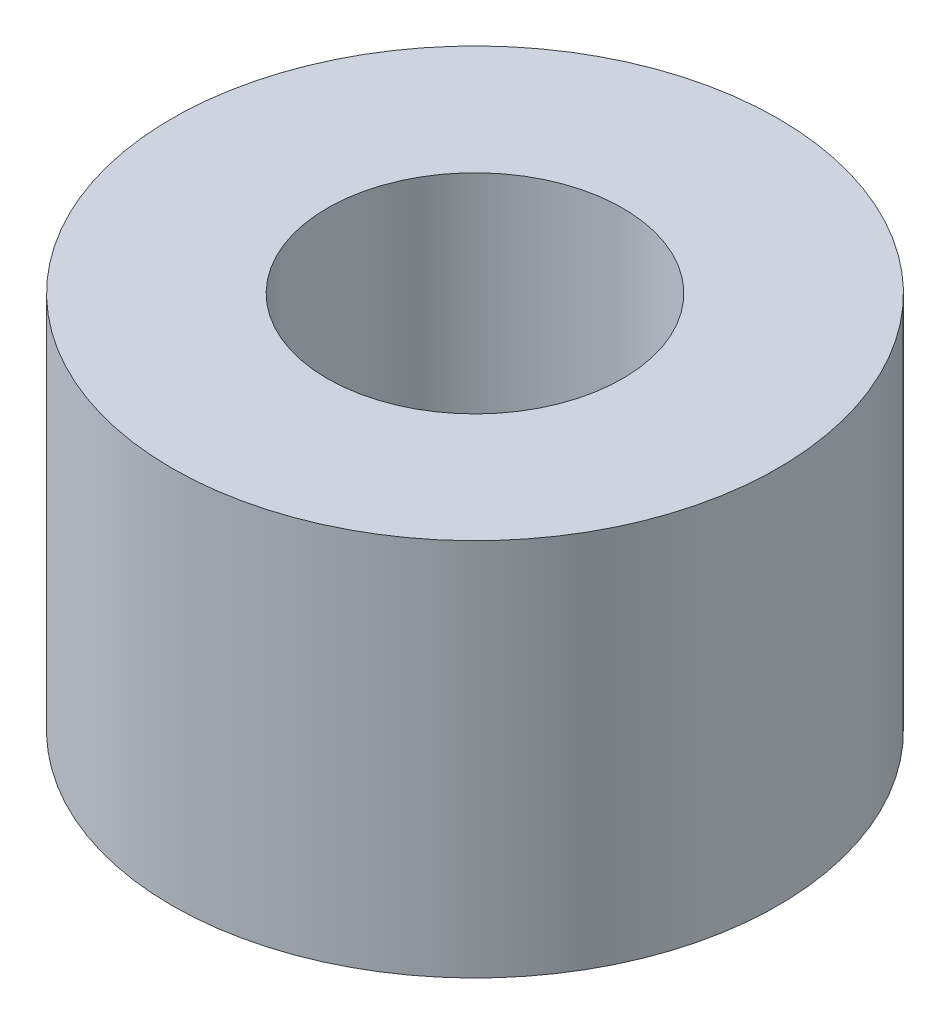
ISO-10303-21;
HEADER;
FILE_DESCRIPTION(('STEP AP214'),'2;1');
FILE_NAME('part.step','',(''),(''),'','','');
FILE_SCHEMA(('AUTOMOTIVE_DESIGN { 1 0 10303 214 1 1 1 1 }'));
ENDSEC;
DATA;
#1=APPLICATION_CONTEXT('core data for automotive mechanical design processes');
#2=APPLICATION_PROTOCOL_DEFINITION('international standard','automotive_design',2000,#1);
#3=PRODUCT_CONTEXT('',#1,'mechanical');
#4=PRODUCT('Part','Part','',(#3));
#5=PRODUCT_RELATED_PRODUCT_CATEGORY('part','',(#4));
#6=PRODUCT_DEFINITION_FORMATION('','',#4);
#7=PRODUCT_DEFINITION_CONTEXT('part definition',#1,'design');
#8=PRODUCT_DEFINITION('design','',#6,#7);
#9=PRODUCT_DEFINITION_SHAPE('','',#8);
#10=(LENGTH_UNIT() NAMED_UNIT(*) SI_UNIT(.MILLI.,.METRE.));
#11=(NAMED_UNIT(*) PLANE_ANGLE_UNIT() SI_UNIT($,.RADIAN.));
#12=(NAMED_UNIT(*) SI_UNIT($,.STERADIAN.) SOLID_ANGLE_UNIT());
#13=UNCERTAINTY_MEASURE_WITH_UNIT(LENGTH_MEASURE(1.E-05),#10,'distance_accuracy_value','');
#14=(GEOMETRIC_REPRESENTATION_CONTEXT(3) GLOBAL_UNCERTAINTY_ASSIGNED_CONTEXT((#13)) GLOBAL_UNIT_ASSIGNED_CONTEXT((#10,
#11,#12)) REPRESENTATION_CONTEXT('',''));
#15=CARTESIAN_POINT('',(0.,0.,0.));
#16=DIRECTION('',(0.,0.,1.));
#17=DIRECTION('',(1.,0.,0.));
#18=AXIS2_PLACEMENT_3D('',#15,#16,#17);
#19=CARTESIAN_POINT('',(0.,5.,0.));
#20=DIRECTION('',(0.,1.,0.));
#21=DIRECTION('',(0.,0.,1.));
#22=AXIS2_PLACEMENT_3D('',#19,#20,#21);
#23=PLANE('',#22);
#24=CARTESIAN_POINT('',(0.,5.,0.));
#25=DIRECTION('',(0.,1.,0.));
#26=DIRECTION('',(0.,0.,1.));
#27=AXIS2_PLACEMENT_3D('',#24,#25,#26);
#28=CIRCLE('',#27,4.);
#29=CARTESIAN_POINT('',(0.,5.,4.));
#30=VERTEX_POINT('',#29);
#31=EDGE_CURVE('E11',#30,#30,#28,.T.);
#32=ORIENTED_EDGE('',*,*,#31,.T.);
#33=EDGE_LOOP('',(#32));
#34=FACE_BOUND('',#33,.T.);
#35=CARTESIAN_POINT('',(0.,5.,0.));
#36=DIRECTION('',(0.,1.,0.));
#37=DIRECTION('',(0.,0.,1.));
#38=AXIS2_PLACEMENT_3D('',#35,#36,#37);
#39=CIRCLE('',#38,1.95);
#40=CARTESIAN_POINT('',(0.,5.,1.95));
#41=VERTEX_POINT('',#40);
#42=EDGE_CURVE('E44',#41,#41,#39,.T.);
#43=ORIENTED_EDGE('',*,*,#42,.F.);
#44=EDGE_LOOP('',(#43));
#45=FACE_BOUND('',#44,.T.);
#46=ADVANCED_FACE('F33',(#34,#45),#23,.T.);
#47=CARTESIAN_POINT('',(0.,0.,0.));
#48=DIRECTION('',(0.,1.,0.));
#49=DIRECTION('',(0.,0.,1.));
#50=AXIS2_PLACEMENT_3D('',#47,#48,#49);
#51=PLANE('',#50);
#52=CARTESIAN_POINT('',(0.,0.,0.));
#53=DIRECTION('',(0.,1.,0.));
#54=DIRECTION('',(0.,0.,1.));
#55=AXIS2_PLACEMENT_3D('',#52,#53,#54);
#56=CIRCLE('',#55,4.);
#57=CARTESIAN_POINT('',(0.,0.,4.));
#58=VERTEX_POINT('',#57);
#59=EDGE_CURVE('E37',#58,#58,#56,.T.);
#60=ORIENTED_EDGE('',*,*,#59,.F.);
#61=EDGE_LOOP('',(#60));
#62=FACE_BOUND('',#61,.T.);
#63=CARTESIAN_POINT('',(0.,0.,0.));
#64=DIRECTION('',(0.,1.,0.));
#65=DIRECTION('',(0.,0.,1.));
#66=AXIS2_PLACEMENT_3D('',#63,#64,#65);
#67=CIRCLE('',#66,1.95);
#68=CARTESIAN_POINT('',(0.,0.,1.95));
#69=VERTEX_POINT('',#68);
#70=EDGE_CURVE('E47',#69,#69,#67,.T.);
#71=ORIENTED_EDGE('',*,*,#70,.T.);
#72=EDGE_LOOP('',(#71));
#73=FACE_BOUND('',#72,.T.);
#74=ADVANCED_FACE('F57',(#62,#73),#51,.F.);
#75=CARTESIAN_POINT('',(0.,5.,0.));
#76=DIRECTION('',(0.,-1.,0.));
#77=DIRECTION('',(0.,0.,-1.));
#78=AXIS2_PLACEMENT_3D('',#75,#76,#77);
#79=CYLINDRICAL_SURFACE('',#78,4.);
#80=ORIENTED_EDGE('',*,*,#31,.F.);
#81=EDGE_LOOP('',(#80));
#82=FACE_BOUND('',#81,.T.);
#83=ORIENTED_EDGE('',*,*,#59,.T.);
#84=EDGE_LOOP('',(#83));
#85=FACE_BOUND('',#84,.T.);
#86=ADVANCED_FACE('F35',(#82,#85),#79,.T.);
#87=CARTESIAN_POINT('',(0.,5.,0.));
#88=DIRECTION('',(0.,-1.,0.));
#89=DIRECTION('',(0.,0.,-1.));
#90=AXIS2_PLACEMENT_3D('',#87,#88,#89);
#91=CYLINDRICAL_SURFACE('',#90,1.95);
#92=ORIENTED_EDGE('',*,*,#42,.T.);
#93=EDGE_LOOP('',(#92));
#94=FACE_BOUND('',#93,.T.);
#95=ORIENTED_EDGE('',*,*,#70,.F.);
#96=EDGE_LOOP('',(#95));
#97=FACE_BOUND('',#96,.T.);
#98=ADVANCED_FACE('F53',(#94,#97),#91,.F.);
#99=CLOSED_SHELL('',(#46,#74,#86,#98));
#100=MANIFOLD_SOLID_BREP('B2',#99);
#101=ADVANCED_BREP_SHAPE_REPRESENTATION('',(#18,#100),#14);
#102=SHAPE_DEFINITION_REPRESENTATION(#9,#101);
ENDSEC;
END-ISO-10303-21;
